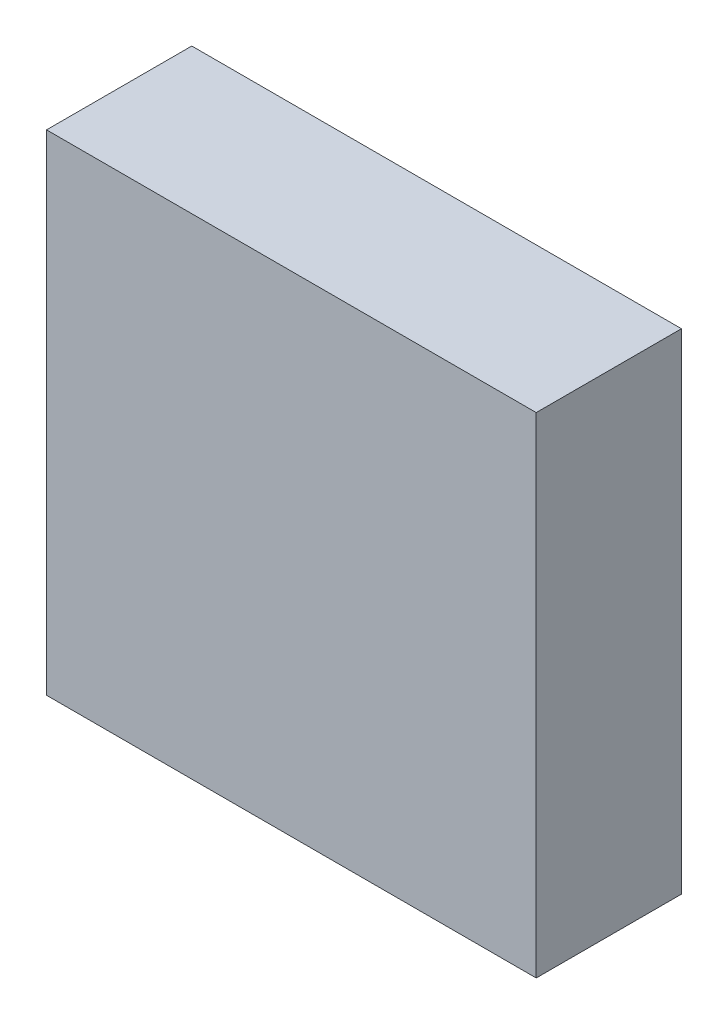
ISO-10303-21;
HEADER;
FILE_DESCRIPTION(('STEP AP214'),'2;1');
FILE_NAME('part.step','',(''),(''),'','','');
FILE_SCHEMA(('AUTOMOTIVE_DESIGN { 1 0 10303 214 1 1 1 1 }'));
ENDSEC;
DATA;
#1=APPLICATION_CONTEXT('core data for automotive mechanical design processes');
#2=APPLICATION_PROTOCOL_DEFINITION('international standard','automotive_design',2000,#1);
#3=PRODUCT_CONTEXT('',#1,'mechanical');
#4=PRODUCT('Part','Part','',(#3));
#5=PRODUCT_RELATED_PRODUCT_CATEGORY('part','',(#4));
#6=PRODUCT_DEFINITION_FORMATION('','',#4);
#7=PRODUCT_DEFINITION_CONTEXT('part definition',#1,'design');
#8=PRODUCT_DEFINITION('design','',#6,#7);
#9=PRODUCT_DEFINITION_SHAPE('','',#8);
#10=(LENGTH_UNIT() NAMED_UNIT(*) SI_UNIT(.MILLI.,.METRE.));
#11=(NAMED_UNIT(*) PLANE_ANGLE_UNIT() SI_UNIT($,.RADIAN.));
#12=(NAMED_UNIT(*) SI_UNIT($,.STERADIAN.) SOLID_ANGLE_UNIT());
#13=UNCERTAINTY_MEASURE_WITH_UNIT(LENGTH_MEASURE(1.E-05),#10,'distance_accuracy_value','');
#14=(GEOMETRIC_REPRESENTATION_CONTEXT(3) GLOBAL_UNCERTAINTY_ASSIGNED_CONTEXT((#13)) GLOBAL_UNIT_ASSIGNED_CONTEXT((#10,
#11,#12)) REPRESENTATION_CONTEXT('',''));
#15=CARTESIAN_POINT('',(0.,0.,0.));
#16=DIRECTION('',(0.,0.,1.));
#17=DIRECTION('',(1.,0.,0.));
#18=AXIS2_PLACEMENT_3D('',#15,#16,#17);
#19=CARTESIAN_POINT('',(-7.62,7.62,4.52000112));
#20=DIRECTION('',(0.,0.,-1.));
#21=DIRECTION('',(-1.,0.,0.));
#22=AXIS2_PLACEMENT_3D('',#19,#20,#21);
#23=PLANE('',#22);
#24=DIRECTION('',(1.,0.,0.));
#25=VECTOR('',#24,1.);
#26=CARTESIAN_POINT('',(-7.62,-7.62,4.52000112));
#27=LINE('',#26,#25);
#28=CARTESIAN_POINT('',(-7.62,-7.62,4.52000112));
#29=VERTEX_POINT('',#28);
#30=CARTESIAN_POINT('',(7.62,-7.62,4.52000112));
#31=VERTEX_POINT('',#30);
#32=EDGE_CURVE('E55',#29,#31,#27,.T.);
#33=ORIENTED_EDGE('',*,*,#32,.T.);
#34=DIRECTION('',(0.,1.,0.));
#35=VECTOR('',#34,1.);
#36=CARTESIAN_POINT('',(7.62,-7.62,4.52000112));
#37=LINE('',#36,#35);
#38=CARTESIAN_POINT('',(7.62,7.62,4.52000112));
#39=VERTEX_POINT('',#38);
#40=EDGE_CURVE('E57',#31,#39,#37,.T.);
#41=ORIENTED_EDGE('',*,*,#40,.T.);
#42=DIRECTION('',(1.,0.,0.));
#43=VECTOR('',#42,1.);
#44=CARTESIAN_POINT('',(7.62,7.62,4.52000112));
#45=LINE('',#44,#43);
#46=CARTESIAN_POINT('',(-7.62,7.62,4.52000112));
#47=VERTEX_POINT('',#46);
#48=EDGE_CURVE('E20',#39,#47,#45,.F.);
#49=ORIENTED_EDGE('',*,*,#48,.T.);
#50=DIRECTION('',(0.,1.,0.));
#51=VECTOR('',#50,1.);
#52=CARTESIAN_POINT('',(-7.62,7.62,4.52000112));
#53=LINE('',#52,#51);
#54=EDGE_CURVE('E80',#47,#29,#53,.F.);
#55=ORIENTED_EDGE('',*,*,#54,.T.);
#56=EDGE_LOOP('',(#33,#41,#49,#55));
#57=FACE_BOUND('',#56,.T.);
#58=ADVANCED_FACE('F17',(#57),#23,.F.);
#59=CARTESIAN_POINT('',(7.62,7.62,0.));
#60=DIRECTION('',(0.,-1.,0.));
#61=DIRECTION('',(0.,0.,-1.));
#62=AXIS2_PLACEMENT_3D('',#59,#60,#61);
#63=PLANE('',#62);
#64=DIRECTION('',(0.,0.,-1.));
#65=VECTOR('',#64,1.);
#66=CARTESIAN_POINT('',(-7.62,7.62,0.));
#67=LINE('',#66,#65);
#68=CARTESIAN_POINT('',(-7.62,7.62,0.));
#69=VERTEX_POINT('',#68);
#70=EDGE_CURVE('E68',#69,#47,#67,.F.);
#71=ORIENTED_EDGE('',*,*,#70,.T.);
#72=ORIENTED_EDGE('',*,*,#48,.F.);
#73=DIRECTION('',(0.,0.,1.));
#74=VECTOR('',#73,1.);
#75=CARTESIAN_POINT('',(7.62,7.62,0.));
#76=LINE('',#75,#74);
#77=CARTESIAN_POINT('',(7.62,7.62,0.));
#78=VERTEX_POINT('',#77);
#79=EDGE_CURVE('E63',#39,#78,#76,.F.);
#80=ORIENTED_EDGE('',*,*,#79,.T.);
#81=DIRECTION('',(-1.,0.,0.));
#82=VECTOR('',#81,1.);
#83=CARTESIAN_POINT('',(-7.62,7.62,0.));
#84=LINE('',#83,#82);
#85=EDGE_CURVE('E83',#69,#78,#84,.F.);
#86=ORIENTED_EDGE('',*,*,#85,.F.);
#87=EDGE_LOOP('',(#71,#72,#80,#86));
#88=FACE_BOUND('',#87,.T.);
#89=ADVANCED_FACE('F65',(#88),#63,.F.);
#90=CARTESIAN_POINT('',(7.62,-7.62,0.));
#91=DIRECTION('',(-1.,0.,0.));
#92=DIRECTION('',(0.,0.,1.));
#93=AXIS2_PLACEMENT_3D('',#90,#91,#92);
#94=PLANE('',#93);
#95=ORIENTED_EDGE('',*,*,#79,.F.);
#96=ORIENTED_EDGE('',*,*,#40,.F.);
#97=DIRECTION('',(0.,0.,1.));
#98=VECTOR('',#97,1.);
#99=CARTESIAN_POINT('',(7.62,-7.62,0.));
#100=LINE('',#99,#98);
#101=CARTESIAN_POINT('',(7.62,-7.62,0.));
#102=VERTEX_POINT('',#101);
#103=EDGE_CURVE('E75',#31,#102,#100,.F.);
#104=ORIENTED_EDGE('',*,*,#103,.T.);
#105=DIRECTION('',(0.,1.,0.));
#106=VECTOR('',#105,1.);
#107=CARTESIAN_POINT('',(7.62,7.62,0.));
#108=LINE('',#107,#106);
#109=EDGE_CURVE('E72',#78,#102,#108,.F.);
#110=ORIENTED_EDGE('',*,*,#109,.F.);
#111=EDGE_LOOP('',(#95,#96,#104,#110));
#112=FACE_BOUND('',#111,.T.);
#113=ADVANCED_FACE('F70',(#112),#94,.F.);
#114=CARTESIAN_POINT('',(-7.62,-7.62,0.));
#115=DIRECTION('',(0.,1.,0.));
#116=DIRECTION('',(0.,0.,1.));
#117=AXIS2_PLACEMENT_3D('',#114,#115,#116);
#118=PLANE('',#117);
#119=ORIENTED_EDGE('',*,*,#103,.F.);
#120=ORIENTED_EDGE('',*,*,#32,.F.);
#121=DIRECTION('',(0.,0.,-1.));
#122=VECTOR('',#121,1.);
#123=CARTESIAN_POINT('',(-7.62,-7.62,0.));
#124=LINE('',#123,#122);
#125=CARTESIAN_POINT('',(-7.62,-7.62,0.));
#126=VERTEX_POINT('',#125);
#127=EDGE_CURVE('E35',#29,#126,#124,.T.);
#128=ORIENTED_EDGE('',*,*,#127,.T.);
#129=DIRECTION('',(-1.,0.,0.));
#130=VECTOR('',#129,1.);
#131=CARTESIAN_POINT('',(-7.62,-7.62,0.));
#132=LINE('',#131,#130);
#133=EDGE_CURVE('E26',#102,#126,#132,.T.);
#134=ORIENTED_EDGE('',*,*,#133,.F.);
#135=EDGE_LOOP('',(#119,#120,#128,#134));
#136=FACE_BOUND('',#135,.T.);
#137=ADVANCED_FACE('F89',(#136),#118,.F.);
#138=CARTESIAN_POINT('',(-7.62,7.62,0.));
#139=DIRECTION('',(1.,0.,0.));
#140=DIRECTION('',(0.,0.,-1.));
#141=AXIS2_PLACEMENT_3D('',#138,#139,#140);
#142=PLANE('',#141);
#143=ORIENTED_EDGE('',*,*,#127,.F.);
#144=ORIENTED_EDGE('',*,*,#54,.F.);
#145=ORIENTED_EDGE('',*,*,#70,.F.);
#146=DIRECTION('',(0.,1.,0.));
#147=VECTOR('',#146,1.);
#148=CARTESIAN_POINT('',(-7.62,7.62,0.));
#149=LINE('',#148,#147);
#150=EDGE_CURVE('E11',#126,#69,#149,.T.);
#151=ORIENTED_EDGE('',*,*,#150,.F.);
#152=EDGE_LOOP('',(#143,#144,#145,#151));
#153=FACE_BOUND('',#152,.T.);
#154=ADVANCED_FACE('F91',(#153),#142,.F.);
#155=CARTESIAN_POINT('',(-7.62,7.62,0.));
#156=DIRECTION('',(0.,0.,-1.));
#157=DIRECTION('',(-1.,0.,0.));
#158=AXIS2_PLACEMENT_3D('',#155,#156,#157);
#159=PLANE('',#158);
#160=ORIENTED_EDGE('',*,*,#133,.T.);
#161=ORIENTED_EDGE('',*,*,#150,.T.);
#162=ORIENTED_EDGE('',*,*,#85,.T.);
#163=ORIENTED_EDGE('',*,*,#109,.T.);
#164=EDGE_LOOP('',(#160,#161,#162,#163));
#165=FACE_BOUND('',#164,.T.);
#166=ADVANCED_FACE('F88',(#165),#159,.T.);
#167=CLOSED_SHELL('',(#58,#89,#113,#137,#154,#166));
#168=MANIFOLD_SOLID_BREP('B1',#167);
#169=ADVANCED_BREP_SHAPE_REPRESENTATION('',(#18,#168),#14);
#170=SHAPE_DEFINITION_REPRESENTATION(#9,#169);
ENDSEC;
END-ISO-10303-21;
